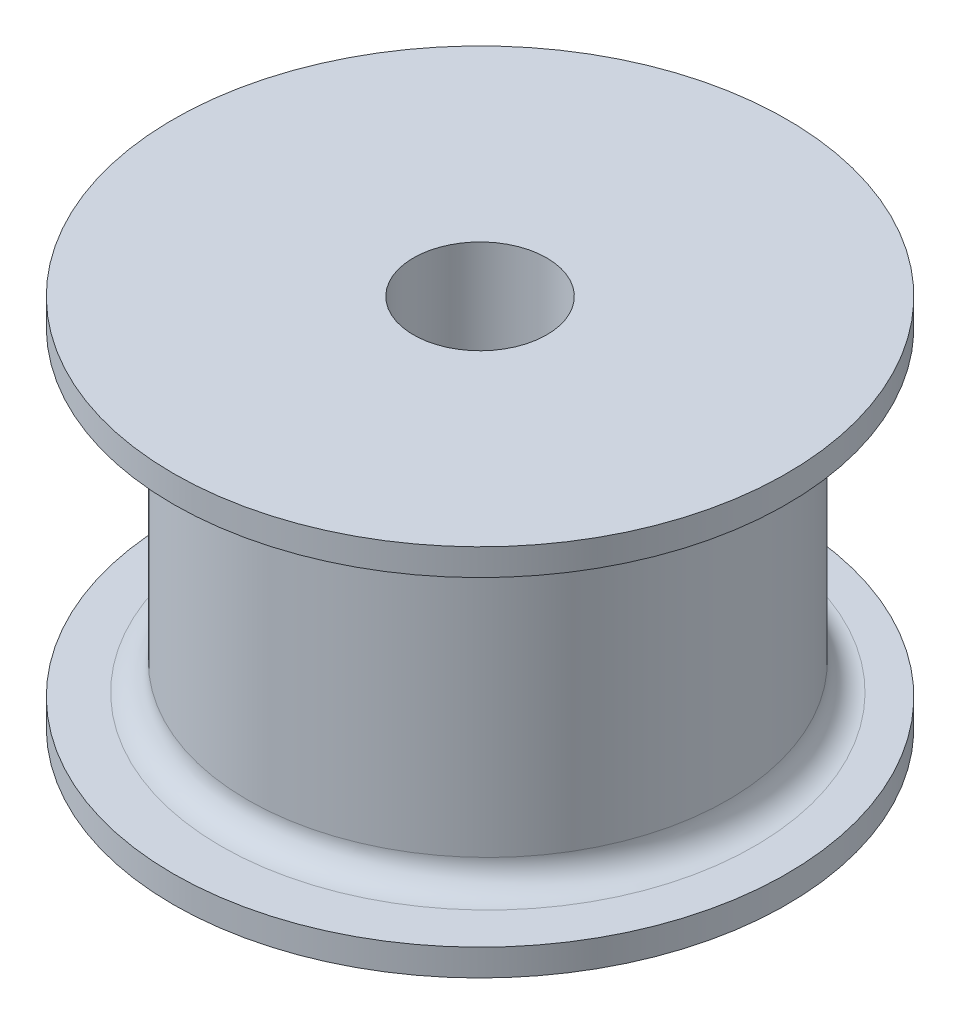
ISO-10303-21;
HEADER;
FILE_DESCRIPTION(('STEP AP214'),'2;1');
FILE_NAME('part.step','',(''),(''),'','','');
FILE_SCHEMA(('AUTOMOTIVE_DESIGN { 1 0 10303 214 1 1 1 1 }'));
ENDSEC;
DATA;
#1=APPLICATION_CONTEXT('core data for automotive mechanical design processes');
#2=APPLICATION_PROTOCOL_DEFINITION('international standard','automotive_design',2000,#1);
#3=PRODUCT_CONTEXT('',#1,'mechanical');
#4=PRODUCT('Part','Part','',(#3));
#5=PRODUCT_RELATED_PRODUCT_CATEGORY('part','',(#4));
#6=PRODUCT_DEFINITION_FORMATION('','',#4);
#7=PRODUCT_DEFINITION_CONTEXT('part definition',#1,'design');
#8=PRODUCT_DEFINITION('design','',#6,#7);
#9=PRODUCT_DEFINITION_SHAPE('','',#8);
#10=(LENGTH_UNIT() NAMED_UNIT(*) SI_UNIT(.MILLI.,.METRE.));
#11=(NAMED_UNIT(*) PLANE_ANGLE_UNIT() SI_UNIT($,.RADIAN.));
#12=(NAMED_UNIT(*) SI_UNIT($,.STERADIAN.) SOLID_ANGLE_UNIT());
#13=UNCERTAINTY_MEASURE_WITH_UNIT(LENGTH_MEASURE(1.E-05),#10,'distance_accuracy_value','');
#14=(GEOMETRIC_REPRESENTATION_CONTEXT(3) GLOBAL_UNCERTAINTY_ASSIGNED_CONTEXT((#13)) GLOBAL_UNIT_ASSIGNED_CONTEXT((#10,
#11,#12)) REPRESENTATION_CONTEXT('',''));
#15=CARTESIAN_POINT('',(0.,0.,0.));
#16=DIRECTION('',(0.,0.,1.));
#17=DIRECTION('',(1.,0.,0.));
#18=AXIS2_PLACEMENT_3D('',#15,#16,#17);
#19=CARTESIAN_POINT('',(0.,1.001,0.));
#20=DIRECTION('',(0.,1.,0.));
#21=DIRECTION('',(0.,0.,1.));
#22=AXIS2_PLACEMENT_3D('',#19,#20,#21);
#23=PLANE('',#22);
#24=CARTESIAN_POINT('',(0.,1.001,-0.291114711728824));
#25=DIRECTION('',(0.,1.,0.));
#26=DIRECTION('',(0.,0.,1.));
#27=AXIS2_PLACEMENT_3D('',#24,#25,#26);
#28=CIRCLE('',#27,10.);
#29=CARTESIAN_POINT('',(0.,1.001,9.70888528827117));
#30=VERTEX_POINT('',#29);
#31=EDGE_CURVE('E42',#30,#30,#28,.F.);
#32=ORIENTED_EDGE('',*,*,#31,.T.);
#33=EDGE_LOOP('',(#32));
#34=FACE_BOUND('',#33,.T.);
#35=CARTESIAN_POINT('',(0.,1.001,0.));
#36=DIRECTION('',(0.,1.,0.));
#37=DIRECTION('',(0.,0.,1.));
#38=AXIS2_PLACEMENT_3D('',#35,#36,#37);
#39=CIRCLE('',#38,11.5);
#40=CARTESIAN_POINT('',(0.,1.001,11.5));
#41=VERTEX_POINT('',#40);
#42=EDGE_CURVE('E55',#41,#41,#39,.T.);
#43=ORIENTED_EDGE('',*,*,#42,.T.);
#44=EDGE_LOOP('',(#43));
#45=FACE_BOUND('',#44,.T.);
#46=ADVANCED_FACE('F31',(#34,#45),#23,.T.);
#47=CARTESIAN_POINT('',(0.,0.001,0.));
#48=DIRECTION('',(0.,-1.,0.));
#49=DIRECTION('',(0.,0.,-1.));
#50=AXIS2_PLACEMENT_3D('',#47,#48,#49);
#51=CYLINDRICAL_SURFACE('',#50,4.95);
#52=CARTESIAN_POINT('',(0.,0.001,0.));
#53=DIRECTION('',(0.,1.,0.));
#54=DIRECTION('',(0.,0.,1.));
#55=AXIS2_PLACEMENT_3D('',#52,#53,#54);
#56=CIRCLE('',#55,4.95);
#57=CARTESIAN_POINT('',(0.,0.001,4.95));
#58=VERTEX_POINT('',#57);
#59=EDGE_CURVE('E51',#58,#58,#56,.T.);
#60=ORIENTED_EDGE('',*,*,#59,.F.);
#61=EDGE_LOOP('',(#60));
#62=FACE_BOUND('',#61,.T.);
#63=CARTESIAN_POINT('',(0.,0.,0.));
#64=DIRECTION('',(0.,1.,0.));
#65=DIRECTION('',(0.,0.,1.));
#66=AXIS2_PLACEMENT_3D('',#63,#64,#65);
#67=CIRCLE('',#66,4.95);
#68=CARTESIAN_POINT('',(0.,0.,4.95));
#69=VERTEX_POINT('',#68);
#70=EDGE_CURVE('E52',#69,#69,#67,.T.);
#71=ORIENTED_EDGE('',*,*,#70,.T.);
#72=EDGE_LOOP('',(#71));
#73=FACE_BOUND('',#72,.T.);
#74=ADVANCED_FACE('F89',(#62,#73),#51,.T.);
#75=CARTESIAN_POINT('',(0.,0.,0.));
#76=DIRECTION('',(0.,1.,0.));
#77=DIRECTION('',(0.,0.,1.));
#78=AXIS2_PLACEMENT_3D('',#75,#76,#77);
#79=PLANE('',#78);
#80=CARTESIAN_POINT('',(0.,0.,0.));
#81=DIRECTION('',(0.,-1.,0.));
#82=DIRECTION('',(0.,0.,-1.));
#83=AXIS2_PLACEMENT_3D('',#80,#81,#82);
#84=CIRCLE('',#83,2.5);
#85=CARTESIAN_POINT('',(0.,0.,-2.5));
#86=VERTEX_POINT('',#85);
#87=EDGE_CURVE('E70',#86,#86,#84,.T.);
#88=ORIENTED_EDGE('',*,*,#87,.F.);
#89=EDGE_LOOP('',(#88));
#90=FACE_BOUND('',#89,.T.);
#91=ORIENTED_EDGE('',*,*,#70,.F.);
#92=EDGE_LOOP('',(#91));
#93=FACE_BOUND('',#92,.T.);
#94=ADVANCED_FACE('F85',(#90,#93),#79,.F.);
#95=CARTESIAN_POINT('',(0.,0.001,0.));
#96=DIRECTION('',(0.,1.,0.));
#97=DIRECTION('',(0.,0.,1.));
#98=AXIS2_PLACEMENT_3D('',#95,#96,#97);
#99=PLANE('',#98);
#100=CARTESIAN_POINT('',(0.,0.001,0.));
#101=DIRECTION('',(0.,1.,0.));
#102=DIRECTION('',(0.,0.,1.));
#103=AXIS2_PLACEMENT_3D('',#100,#101,#102);
#104=CIRCLE('',#103,11.5);
#105=CARTESIAN_POINT('',(0.,0.001,11.5));
#106=VERTEX_POINT('',#105);
#107=EDGE_CURVE('E58',#106,#106,#104,.T.);
#108=ORIENTED_EDGE('',*,*,#107,.F.);
#109=EDGE_LOOP('',(#108));
#110=FACE_BOUND('',#109,.T.);
#111=ORIENTED_EDGE('',*,*,#59,.T.);
#112=EDGE_LOOP('',(#111));
#113=FACE_BOUND('',#112,.T.);
#114=ADVANCED_FACE('F88',(#110,#113),#99,.F.);
#115=CARTESIAN_POINT('',(0.,1.001,0.));
#116=DIRECTION('',(0.,-1.,0.));
#117=DIRECTION('',(0.,0.,-1.));
#118=AXIS2_PLACEMENT_3D('',#115,#116,#117);
#119=CYLINDRICAL_SURFACE('',#118,11.5);
#120=ORIENTED_EDGE('',*,*,#42,.F.);
#121=EDGE_LOOP('',(#120));
#122=FACE_BOUND('',#121,.T.);
#123=ORIENTED_EDGE('',*,*,#107,.T.);
#124=EDGE_LOOP('',(#123));
#125=FACE_BOUND('',#124,.T.);
#126=ADVANCED_FACE('F120',(#122,#125),#119,.T.);
#127=CARTESIAN_POINT('',(0.,13.001,-0.291114711728824));
#128=DIRECTION('',(0.,-1.,0.));
#129=DIRECTION('',(0.,0.,-1.));
#130=AXIS2_PLACEMENT_3D('',#127,#128,#129);
#131=CYLINDRICAL_SURFACE('',#130,9.);
#132=CARTESIAN_POINT('',(0.,12.001,-0.291114711728824));
#133=DIRECTION('',(0.,1.,0.));
#134=DIRECTION('',(0.,0.,1.));
#135=AXIS2_PLACEMENT_3D('',#132,#133,#134);
#136=CIRCLE('',#135,9.);
#137=CARTESIAN_POINT('',(0.,12.001,8.70888528827118));
#138=VERTEX_POINT('',#137);
#139=EDGE_CURVE('E10',#138,#138,#136,.F.);
#140=ORIENTED_EDGE('',*,*,#139,.T.);
#141=EDGE_LOOP('',(#140));
#142=FACE_BOUND('',#141,.T.);
#143=CARTESIAN_POINT('',(0.,2.001,-0.291114711728824));
#144=DIRECTION('',(0.,1.,0.));
#145=DIRECTION('',(0.,0.,1.));
#146=AXIS2_PLACEMENT_3D('',#143,#144,#145);
#147=CIRCLE('',#146,9.);
#148=CARTESIAN_POINT('',(0.,2.001,8.70888528827118));
#149=VERTEX_POINT('',#148);
#150=EDGE_CURVE('E46',#149,#149,#147,.T.);
#151=ORIENTED_EDGE('',*,*,#150,.T.);
#152=EDGE_LOOP('',(#151));
#153=FACE_BOUND('',#152,.T.);
#154=ADVANCED_FACE('F117',(#142,#153),#131,.T.);
#155=CARTESIAN_POINT('',(0.,13.001,0.));
#156=DIRECTION('',(0.,1.,0.));
#157=DIRECTION('',(0.,0.,1.));
#158=AXIS2_PLACEMENT_3D('',#155,#156,#157);
#159=PLANE('',#158);
#160=CARTESIAN_POINT('',(0.,13.001,-0.291114711728824));
#161=DIRECTION('',(0.,1.,0.));
#162=DIRECTION('',(0.,0.,1.));
#163=AXIS2_PLACEMENT_3D('',#160,#161,#162);
#164=CIRCLE('',#163,10.);
#165=CARTESIAN_POINT('',(0.,13.001,9.70888528827117));
#166=VERTEX_POINT('',#165);
#167=EDGE_CURVE('E38',#166,#166,#164,.T.);
#168=ORIENTED_EDGE('',*,*,#167,.T.);
#169=EDGE_LOOP('',(#168));
#170=FACE_BOUND('',#169,.T.);
#171=CARTESIAN_POINT('',(0.,13.001,0.));
#172=DIRECTION('',(0.,1.,0.));
#173=DIRECTION('',(0.,0.,1.));
#174=AXIS2_PLACEMENT_3D('',#171,#172,#173);
#175=CIRCLE('',#174,11.5);
#176=CARTESIAN_POINT('',(0.,13.001,11.5));
#177=VERTEX_POINT('',#176);
#178=EDGE_CURVE('E64',#177,#177,#175,.T.);
#179=ORIENTED_EDGE('',*,*,#178,.F.);
#180=EDGE_LOOP('',(#179));
#181=FACE_BOUND('',#180,.T.);
#182=ADVANCED_FACE('F119',(#170,#181),#159,.F.);
#183=CARTESIAN_POINT('',(0.,14.001,0.));
#184=DIRECTION('',(0.,-1.,0.));
#185=DIRECTION('',(0.,0.,-1.));
#186=AXIS2_PLACEMENT_3D('',#183,#184,#185);
#187=CYLINDRICAL_SURFACE('',#186,11.5);
#188=CARTESIAN_POINT('',(0.,14.001,0.));
#189=DIRECTION('',(0.,1.,0.));
#190=DIRECTION('',(0.,0.,1.));
#191=AXIS2_PLACEMENT_3D('',#188,#189,#190);
#192=CIRCLE('',#191,11.5);
#193=CARTESIAN_POINT('',(0.,14.001,11.5));
#194=VERTEX_POINT('',#193);
#195=EDGE_CURVE('E61',#194,#194,#192,.T.);
#196=ORIENTED_EDGE('',*,*,#195,.F.);
#197=EDGE_LOOP('',(#196));
#198=FACE_BOUND('',#197,.T.);
#199=ORIENTED_EDGE('',*,*,#178,.T.);
#200=EDGE_LOOP('',(#199));
#201=FACE_BOUND('',#200,.T.);
#202=ADVANCED_FACE('F111',(#198,#201),#187,.T.);
#203=CARTESIAN_POINT('',(0.,14.001,0.));
#204=DIRECTION('',(0.,1.,0.));
#205=DIRECTION('',(0.,0.,1.));
#206=AXIS2_PLACEMENT_3D('',#203,#204,#205);
#207=PLANE('',#206);
#208=CARTESIAN_POINT('',(0.,14.001,0.));
#209=DIRECTION('',(0.,-1.,0.));
#210=DIRECTION('',(0.,0.,-1.));
#211=AXIS2_PLACEMENT_3D('',#208,#209,#210);
#212=CIRCLE('',#211,2.5);
#213=CARTESIAN_POINT('',(0.,14.001,-2.5));
#214=VERTEX_POINT('',#213);
#215=EDGE_CURVE('E67',#214,#214,#212,.T.);
#216=ORIENTED_EDGE('',*,*,#215,.T.);
#217=EDGE_LOOP('',(#216));
#218=FACE_BOUND('',#217,.T.);
#219=ORIENTED_EDGE('',*,*,#195,.T.);
#220=EDGE_LOOP('',(#219));
#221=FACE_BOUND('',#220,.T.);
#222=ADVANCED_FACE('F76',(#218,#221),#207,.T.);
#223=CARTESIAN_POINT('',(0.,2.001,-0.291114711728824));
#224=DIRECTION('',(0.,1.,0.));
#225=DIRECTION('',(0.,0.,1.));
#226=AXIS2_PLACEMENT_3D('',#223,#224,#225);
#227=TOROIDAL_SURFACE('',#226,10.,1.);
#228=ORIENTED_EDGE('',*,*,#31,.F.);
#229=EDGE_LOOP('',(#228));
#230=FACE_BOUND('',#229,.T.);
#231=ORIENTED_EDGE('',*,*,#150,.F.);
#232=EDGE_LOOP('',(#231));
#233=FACE_BOUND('',#232,.T.);
#234=ADVANCED_FACE('F103',(#230,#233),#227,.F.);
#235=CARTESIAN_POINT('',(0.,12.001,-0.291114711728824));
#236=DIRECTION('',(0.,1.,0.));
#237=DIRECTION('',(0.,0.,1.));
#238=AXIS2_PLACEMENT_3D('',#235,#236,#237);
#239=TOROIDAL_SURFACE('',#238,10.,1.);
#240=ORIENTED_EDGE('',*,*,#139,.F.);
#241=EDGE_LOOP('',(#240));
#242=FACE_BOUND('',#241,.T.);
#243=ORIENTED_EDGE('',*,*,#167,.F.);
#244=EDGE_LOOP('',(#243));
#245=FACE_BOUND('',#244,.T.);
#246=ADVANCED_FACE('F33',(#242,#245),#239,.F.);
#247=CARTESIAN_POINT('',(0.,14.001,0.));
#248=DIRECTION('',(0.,-1.,0.));
#249=DIRECTION('',(0.,0.,-1.));
#250=AXIS2_PLACEMENT_3D('',#247,#248,#249);
#251=CYLINDRICAL_SURFACE('',#250,2.5);
#252=ORIENTED_EDGE('',*,*,#215,.F.);
#253=EDGE_LOOP('',(#252));
#254=FACE_BOUND('',#253,.T.);
#255=ORIENTED_EDGE('',*,*,#87,.T.);
#256=EDGE_LOOP('',(#255));
#257=FACE_BOUND('',#256,.T.);
#258=ADVANCED_FACE('F79',(#254,#257),#251,.F.);
#259=CLOSED_SHELL('',(#46,#74,#94,#114,#126,#154,#182,#202,#222,#234,#246,#258));
#260=MANIFOLD_SOLID_BREP('B2',#259);
#261=ADVANCED_BREP_SHAPE_REPRESENTATION('',(#18,#260),#14);
#262=SHAPE_DEFINITION_REPRESENTATION(#9,#261);
ENDSEC;
END-ISO-10303-21;
